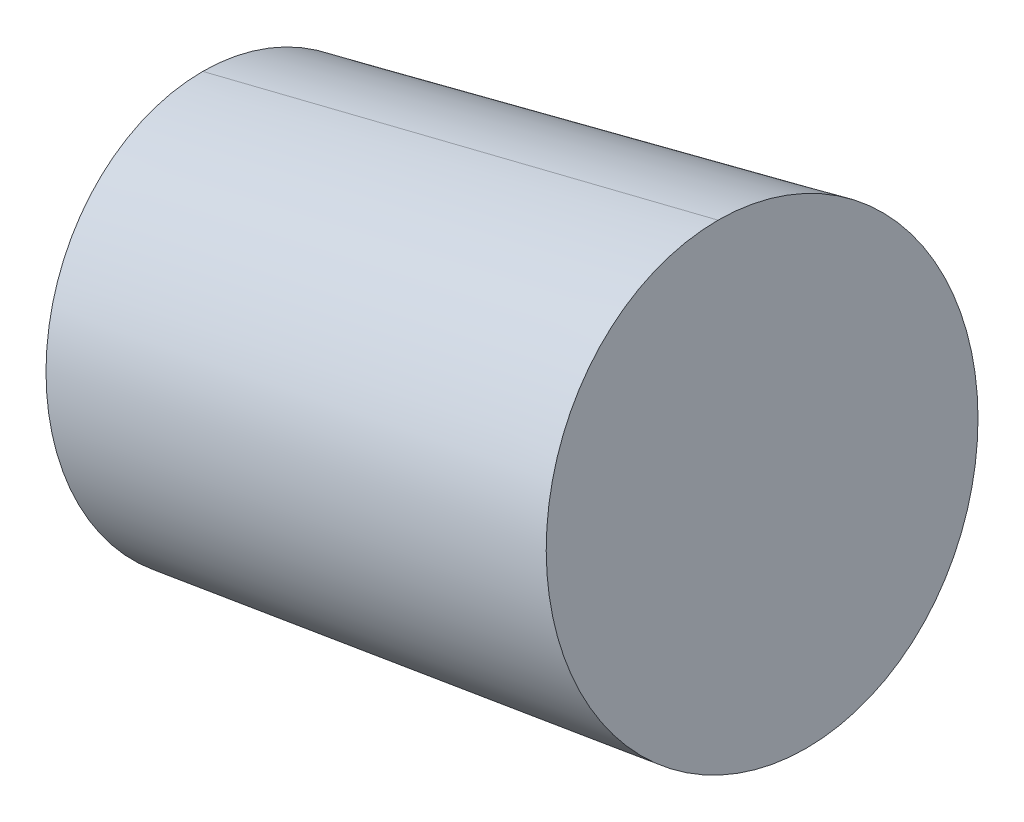
ISO-10303-21;
HEADER;
FILE_DESCRIPTION(('STEP AP214'),'2;1');
FILE_NAME('part.step','',(''),(''),'','','');
FILE_SCHEMA(('AUTOMOTIVE_DESIGN { 1 0 10303 214 1 1 1 1 }'));
ENDSEC;
DATA;
#1=APPLICATION_CONTEXT('core data for automotive mechanical design processes');
#2=APPLICATION_PROTOCOL_DEFINITION('international standard','automotive_design',2000,#1);
#3=PRODUCT_CONTEXT('',#1,'mechanical');
#4=PRODUCT('Part','Part','',(#3));
#5=PRODUCT_RELATED_PRODUCT_CATEGORY('part','',(#4));
#6=PRODUCT_DEFINITION_FORMATION('','',#4);
#7=PRODUCT_DEFINITION_CONTEXT('part definition',#1,'design');
#8=PRODUCT_DEFINITION('design','',#6,#7);
#9=PRODUCT_DEFINITION_SHAPE('','',#8);
#10=(LENGTH_UNIT() NAMED_UNIT(*) SI_UNIT(.MILLI.,.METRE.));
#11=(NAMED_UNIT(*) PLANE_ANGLE_UNIT() SI_UNIT($,.RADIAN.));
#12=(NAMED_UNIT(*) SI_UNIT($,.STERADIAN.) SOLID_ANGLE_UNIT());
#13=UNCERTAINTY_MEASURE_WITH_UNIT(LENGTH_MEASURE(1.E-05),#10,'distance_accuracy_value','');
#14=(GEOMETRIC_REPRESENTATION_CONTEXT(3) GLOBAL_UNCERTAINTY_ASSIGNED_CONTEXT((#13)) GLOBAL_UNIT_ASSIGNED_CONTEXT((#10,
#11,#12)) REPRESENTATION_CONTEXT('',''));
#15=CARTESIAN_POINT('',(0.,0.,0.));
#16=DIRECTION('',(0.,0.,1.));
#17=DIRECTION('',(1.,0.,0.));
#18=AXIS2_PLACEMENT_3D('',#15,#16,#17);
#19=CARTESIAN_POINT('',(14.0617381578798,28.3327867574799,0.));
#20=DIRECTION('',(-0.978038604349685,-0.208423819180344,0.));
#21=DIRECTION('',(0.208423819180344,-0.978038604349685,0.));
#22=AXIS2_PLACEMENT_3D('',#19,#20,#21);
#23=PLANE('',#22);
#24=CARTESIAN_POINT('',(14.0617381578797,28.3327867574799,0.));
#25=DIRECTION('',(-0.978038604349685,-0.208423819180344,0.));
#26=DIRECTION('',(0.208423819180344,-0.978038604349685,0.));
#27=AXIS2_PLACEMENT_3D('',#24,#25,#26);
#28=CIRCLE('',#27,4.7222609720471);
#29=CARTESIAN_POINT('',(13.0775064909193,32.9513402879559,0.));
#30=VERTEX_POINT('',#29);
#31=CARTESIAN_POINT('',(15.04596982484,23.714233227004,0.));
#32=VERTEX_POINT('',#31);
#33=EDGE_CURVE('E11',#30,#32,#28,.T.);
#34=ORIENTED_EDGE('',*,*,#33,.F.);
#35=CARTESIAN_POINT('',(14.0617381578797,28.3327867574799,0.));
#36=DIRECTION('',(-0.978038604349685,-0.208423819180344,0.));
#37=DIRECTION('',(0.208423819180344,-0.978038604349685,0.));
#38=AXIS2_PLACEMENT_3D('',#35,#36,#37);
#39=CIRCLE('',#38,4.7222609720471);
#40=EDGE_CURVE('E25',#32,#30,#39,.T.);
#41=ORIENTED_EDGE('',*,*,#40,.F.);
#42=EDGE_LOOP('',(#34,#41));
#43=FACE_BOUND('',#42,.T.);
#44=ADVANCED_FACE('F17',(#43),#23,.F.);
#45=CARTESIAN_POINT('',(14.0617381578797,28.3327867574799,0.));
#46=DIRECTION('',(0.978038604349685,0.208423819180344,0.));
#47=DIRECTION('',(0.,0.,-1.));
#48=AXIS2_PLACEMENT_3D('',#45,#46,#47);
#49=CONICAL_SURFACE('',#48,4.72226097204709,0.0350113047949735);
#50=DIRECTION('',(0.984734929038763,0.17406067772769,0.));
#51=VECTOR('',#50,1.);
#52=CARTESIAN_POINT('',(3.35868549005059,21.648401527406,0.));
#53=LINE('',#52,#51);
#54=CARTESIAN_POINT('',(3.3586854900506,21.648401527406,0.));
#55=VERTEX_POINT('',#54);
#56=EDGE_CURVE('E43',#55,#32,#53,.T.);
#57=ORIENTED_EDGE('',*,*,#56,.T.);
#58=ORIENTED_EDGE('',*,*,#40,.T.);
#59=DIRECTION('',(0.970143530747328,0.242531502591124,0.));
#60=VECTOR('',#59,1.);
#61=CARTESIAN_POINT('',(1.56339954188653,30.072865535676,0.));
#62=LINE('',#61,#60);
#63=CARTESIAN_POINT('',(1.56339954188653,30.072865535676,0.));
#64=VERTEX_POINT('',#63);
#65=EDGE_CURVE('E45',#64,#30,#62,.T.);
#66=ORIENTED_EDGE('',*,*,#65,.F.);
#67=CARTESIAN_POINT('',(2.46104251596857,25.860633531541,0.));
#68=DIRECTION('',(-0.978038604349685,-0.208423819180344,0.));
#69=DIRECTION('',(0.208423819180344,-0.978038604349685,0.));
#70=AXIS2_PLACEMENT_3D('',#67,#68,#69);
#71=CIRCLE('',#70,4.30681568743984);
#72=EDGE_CURVE('E40',#55,#64,#71,.T.);
#73=ORIENTED_EDGE('',*,*,#72,.F.);
#74=EDGE_LOOP('',(#57,#58,#66,#73));
#75=FACE_BOUND('',#74,.T.);
#76=ADVANCED_FACE('F42',(#75),#49,.T.);
#77=CARTESIAN_POINT('',(3.35868549005061,21.648401527406,0.));
#78=DIRECTION('',(0.978038604349685,0.208423819180344,0.));
#79=DIRECTION('',(-0.208423819180344,0.978038604349685,0.));
#80=AXIS2_PLACEMENT_3D('',#77,#78,#79);
#81=PLANE('',#80);
#82=ORIENTED_EDGE('',*,*,#72,.T.);
#83=CARTESIAN_POINT('',(2.46104251596857,25.860633531541,0.));
#84=DIRECTION('',(-0.978038604349685,-0.208423819180344,0.));
#85=DIRECTION('',(0.208423819180344,-0.978038604349685,0.));
#86=AXIS2_PLACEMENT_3D('',#83,#84,#85);
#87=CIRCLE('',#86,4.30681568743984);
#88=EDGE_CURVE('E49',#64,#55,#87,.T.);
#89=ORIENTED_EDGE('',*,*,#88,.T.);
#90=EDGE_LOOP('',(#82,#89));
#91=FACE_BOUND('',#90,.T.);
#92=ADVANCED_FACE('F54',(#91),#81,.F.);
#93=CARTESIAN_POINT('',(14.0617381578797,28.3327867574799,0.));
#94=DIRECTION('',(0.978038604349685,0.208423819180344,0.));
#95=DIRECTION('',(0.,0.,1.));
#96=AXIS2_PLACEMENT_3D('',#93,#94,#95);
#97=CONICAL_SURFACE('',#96,4.72226097204709,0.0350113047949735);
#98=ORIENTED_EDGE('',*,*,#56,.F.);
#99=ORIENTED_EDGE('',*,*,#88,.F.);
#100=ORIENTED_EDGE('',*,*,#65,.T.);
#101=ORIENTED_EDGE('',*,*,#33,.T.);
#102=EDGE_LOOP('',(#98,#99,#100,#101));
#103=FACE_BOUND('',#102,.T.);
#104=ADVANCED_FACE('F52',(#103),#97,.T.);
#105=CLOSED_SHELL('',(#44,#76,#92,#104));
#106=MANIFOLD_SOLID_BREP('B1',#105);
#107=ADVANCED_BREP_SHAPE_REPRESENTATION('',(#18,#106),#14);
#108=SHAPE_DEFINITION_REPRESENTATION(#9,#107);
ENDSEC;
END-ISO-10303-21;
